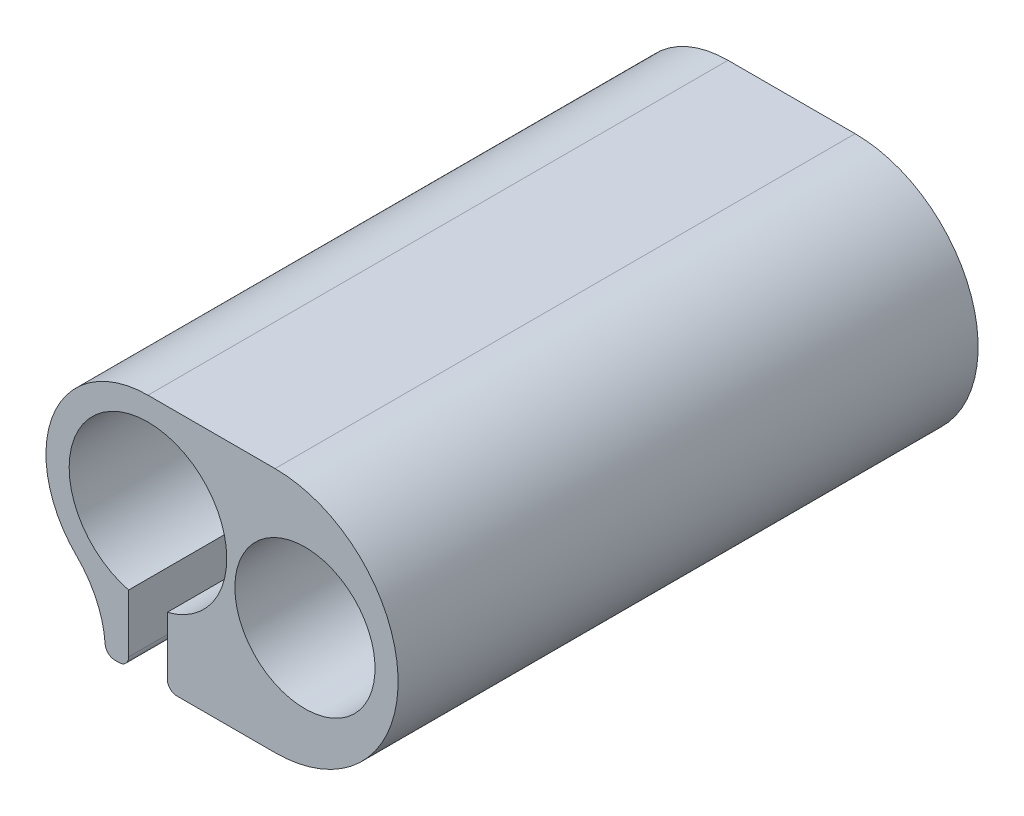
ISO-10303-21;
HEADER;
FILE_DESCRIPTION(('STEP AP214'),'2;1');
FILE_NAME('part.step','',(''),(''),'','','');
FILE_SCHEMA(('AUTOMOTIVE_DESIGN { 1 0 10303 214 1 1 1 1 }'));
ENDSEC;
DATA;
#1=APPLICATION_CONTEXT('core data for automotive mechanical design processes');
#2=APPLICATION_PROTOCOL_DEFINITION('international standard','automotive_design',2000,#1);
#3=PRODUCT_CONTEXT('',#1,'mechanical');
#4=PRODUCT('Part','Part','',(#3));
#5=PRODUCT_RELATED_PRODUCT_CATEGORY('part','',(#4));
#6=PRODUCT_DEFINITION_FORMATION('','',#4);
#7=PRODUCT_DEFINITION_CONTEXT('part definition',#1,'design');
#8=PRODUCT_DEFINITION('design','',#6,#7);
#9=PRODUCT_DEFINITION_SHAPE('','',#8);
#10=(LENGTH_UNIT() NAMED_UNIT(*) SI_UNIT(.MILLI.,.METRE.));
#11=(NAMED_UNIT(*) PLANE_ANGLE_UNIT() SI_UNIT($,.RADIAN.));
#12=(NAMED_UNIT(*) SI_UNIT($,.STERADIAN.) SOLID_ANGLE_UNIT());
#13=UNCERTAINTY_MEASURE_WITH_UNIT(LENGTH_MEASURE(1.E-05),#10,'distance_accuracy_value','');
#14=(GEOMETRIC_REPRESENTATION_CONTEXT(3) GLOBAL_UNCERTAINTY_ASSIGNED_CONTEXT((#13)) GLOBAL_UNIT_ASSIGNED_CONTEXT((#10,
#11,#12)) REPRESENTATION_CONTEXT('',''));
#15=CARTESIAN_POINT('',(0.,0.,0.));
#16=DIRECTION('',(0.,0.,1.));
#17=DIRECTION('',(1.,0.,0.));
#18=AXIS2_PLACEMENT_3D('',#15,#16,#17);
#19=CARTESIAN_POINT('',(0.,0.,60.));
#20=DIRECTION('',(0.,0.,-1.));
#21=DIRECTION('',(-1.,0.,0.));
#22=AXIS2_PLACEMENT_3D('',#19,#20,#21);
#23=CYLINDRICAL_SURFACE('',#22,8.15);
#24=CARTESIAN_POINT('',(0.,0.,0.));
#25=DIRECTION('',(0.,0.,-1.));
#26=DIRECTION('',(-1.,0.,0.));
#27=AXIS2_PLACEMENT_3D('',#24,#25,#26);
#28=CIRCLE('',#27,8.15);
#29=CARTESIAN_POINT('',(-2.,-7.90079109963047,0.));
#30=VERTEX_POINT('',#29);
#31=CARTESIAN_POINT('',(2.,-7.90079109963047,0.));
#32=VERTEX_POINT('',#31);
#33=EDGE_CURVE('E146',#30,#32,#28,.T.);
#34=ORIENTED_EDGE('',*,*,#33,.T.);
#35=DIRECTION('',(0.,0.,-1.));
#36=VECTOR('',#35,1.);
#37=CARTESIAN_POINT('',(2.,-7.90079109963047,60.));
#38=LINE('',#37,#36);
#39=CARTESIAN_POINT('',(2.,-7.90079109963047,60.));
#40=VERTEX_POINT('',#39);
#41=EDGE_CURVE('E130',#40,#32,#38,.T.);
#42=ORIENTED_EDGE('',*,*,#41,.F.);
#43=CARTESIAN_POINT('',(0.,0.,60.));
#44=DIRECTION('',(0.,0.,-1.));
#45=DIRECTION('',(-1.,0.,0.));
#46=AXIS2_PLACEMENT_3D('',#43,#44,#45);
#47=CIRCLE('',#46,8.15);
#48=CARTESIAN_POINT('',(-2.,-7.90079109963047,60.));
#49=VERTEX_POINT('',#48);
#50=EDGE_CURVE('E134',#49,#40,#47,.T.);
#51=ORIENTED_EDGE('',*,*,#50,.F.);
#52=DIRECTION('',(0.,0.,-1.));
#53=VECTOR('',#52,1.);
#54=CARTESIAN_POINT('',(-2.,-7.90079109963047,60.));
#55=LINE('',#54,#53);
#56=EDGE_CURVE('E208',#49,#30,#55,.T.);
#57=ORIENTED_EDGE('',*,*,#56,.T.);
#58=EDGE_LOOP('',(#34,#42,#51,#57));
#59=FACE_BOUND('',#58,.T.);
#60=ADVANCED_FACE('F37',(#59),#23,.F.);
#61=CARTESIAN_POINT('',(2.,-7.90079109963047,60.));
#62=DIRECTION('',(1.,0.,0.));
#63=DIRECTION('',(0.,1.,0.));
#64=AXIS2_PLACEMENT_3D('',#61,#62,#63);
#65=PLANE('',#64);
#66=DIRECTION('',(0.,-1.,0.));
#67=VECTOR('',#66,1.);
#68=CARTESIAN_POINT('',(2.,-7.90079109963047,0.));
#69=LINE('',#68,#67);
#70=CARTESIAN_POINT('',(2.,-13.9007910996305,0.));
#71=VERTEX_POINT('',#70);
#72=EDGE_CURVE('E193',#32,#71,#69,.T.);
#73=ORIENTED_EDGE('',*,*,#72,.T.);
#74=DIRECTION('',(0.,0.,-1.));
#75=VECTOR('',#74,1.);
#76=CARTESIAN_POINT('',(2.,-13.9007910996305,60.));
#77=LINE('',#76,#75);
#78=CARTESIAN_POINT('',(2.,-13.9007910996305,60.));
#79=VERTEX_POINT('',#78);
#80=EDGE_CURVE('E11',#71,#79,#77,.F.);
#81=ORIENTED_EDGE('',*,*,#80,.T.);
#82=DIRECTION('',(0.,-1.,0.));
#83=VECTOR('',#82,1.);
#84=CARTESIAN_POINT('',(2.,-7.90079109963047,60.));
#85=LINE('',#84,#83);
#86=EDGE_CURVE('E125',#40,#79,#85,.T.);
#87=ORIENTED_EDGE('',*,*,#86,.F.);
#88=ORIENTED_EDGE('',*,*,#41,.T.);
#89=EDGE_LOOP('',(#73,#81,#87,#88));
#90=FACE_BOUND('',#89,.T.);
#91=ADVANCED_FACE('F128',(#90),#65,.F.);
#92=CARTESIAN_POINT('',(4.4,-14.9007910996305,60.));
#93=DIRECTION('',(0.,1.,0.));
#94=DIRECTION('',(0.,0.,1.));
#95=AXIS2_PLACEMENT_3D('',#92,#93,#94);
#96=PLANE('',#95);
#97=DIRECTION('',(1.,0.,0.));
#98=VECTOR('',#97,1.);
#99=CARTESIAN_POINT('',(2.,-14.9007910996305,60.));
#100=LINE('',#99,#98);
#101=CARTESIAN_POINT('',(3.,-14.9007910996305,60.));
#102=VERTEX_POINT('',#101);
#103=CARTESIAN_POINT('',(13.1471428727332,-14.9007910996305,60.));
#104=VERTEX_POINT('',#103);
#105=EDGE_CURVE('E133',#102,#104,#100,.T.);
#106=ORIENTED_EDGE('',*,*,#105,.F.);
#107=DIRECTION('',(0.,0.,-1.));
#108=VECTOR('',#107,1.);
#109=CARTESIAN_POINT('',(3.,-14.9007910996305,60.));
#110=LINE('',#109,#108);
#111=CARTESIAN_POINT('',(3.,-14.9007910996305,0.));
#112=VERTEX_POINT('',#111);
#113=EDGE_CURVE('E45',#102,#112,#110,.T.);
#114=ORIENTED_EDGE('',*,*,#113,.T.);
#115=DIRECTION('',(1.,0.,0.));
#116=VECTOR('',#115,1.);
#117=CARTESIAN_POINT('',(4.4,-14.9007910996305,0.));
#118=LINE('',#117,#116);
#119=CARTESIAN_POINT('',(13.1471428727332,-14.9007910996305,0.));
#120=VERTEX_POINT('',#119);
#121=EDGE_CURVE('E185',#112,#120,#118,.T.);
#122=ORIENTED_EDGE('',*,*,#121,.T.);
#123=DIRECTION('',(0.,0.,-1.));
#124=VECTOR('',#123,1.);
#125=CARTESIAN_POINT('',(13.1471428727332,-14.9007910996305,60.));
#126=LINE('',#125,#124);
#127=EDGE_CURVE('E148',#104,#120,#126,.T.);
#128=ORIENTED_EDGE('',*,*,#127,.F.);
#129=EDGE_LOOP('',(#106,#114,#122,#128));
#130=FACE_BOUND('',#129,.T.);
#131=ADVANCED_FACE('F183',(#130),#96,.F.);
#132=CARTESIAN_POINT('',(13.1471428727332,-2.17539554981523,60.));
#133=DIRECTION('',(0.,0.,-1.));
#134=DIRECTION('',(-1.,0.,0.));
#135=AXIS2_PLACEMENT_3D('',#132,#133,#134);
#136=CYLINDRICAL_SURFACE('',#135,12.7253955498152);
#137=CARTESIAN_POINT('',(13.1471428727332,-2.17539554981523,0.));
#138=DIRECTION('',(0.,0.,1.));
#139=DIRECTION('',(-1.,0.,0.));
#140=AXIS2_PLACEMENT_3D('',#137,#138,#139);
#141=CIRCLE('',#140,12.7253955498152);
#142=CARTESIAN_POINT('',(13.1471428727332,10.55,0.));
#143=VERTEX_POINT('',#142);
#144=EDGE_CURVE('E192',#120,#143,#141,.T.);
#145=ORIENTED_EDGE('',*,*,#144,.T.);
#146=DIRECTION('',(0.,0.,-1.));
#147=VECTOR('',#146,1.);
#148=CARTESIAN_POINT('',(13.1471428727332,10.55,60.));
#149=LINE('',#148,#147);
#150=CARTESIAN_POINT('',(13.1471428727332,10.55,60.));
#151=VERTEX_POINT('',#150);
#152=EDGE_CURVE('E153',#151,#143,#149,.T.);
#153=ORIENTED_EDGE('',*,*,#152,.F.);
#154=CARTESIAN_POINT('',(13.1471428727332,-2.17539554981523,60.));
#155=DIRECTION('',(0.,0.,1.));
#156=DIRECTION('',(-1.,0.,0.));
#157=AXIS2_PLACEMENT_3D('',#154,#155,#156);
#158=CIRCLE('',#157,12.7253955498152);
#159=EDGE_CURVE('E261',#104,#151,#158,.T.);
#160=ORIENTED_EDGE('',*,*,#159,.F.);
#161=ORIENTED_EDGE('',*,*,#127,.T.);
#162=EDGE_LOOP('',(#145,#153,#160,#161));
#163=FACE_BOUND('',#162,.T.);
#164=ADVANCED_FACE('F263',(#163),#136,.T.);
#165=CARTESIAN_POINT('',(13.1471428727332,10.55,60.));
#166=DIRECTION('',(0.,-1.,0.));
#167=DIRECTION('',(1.,0.,0.));
#168=AXIS2_PLACEMENT_3D('',#165,#166,#167);
#169=PLANE('',#168);
#170=DIRECTION('',(-1.,0.,0.));
#171=VECTOR('',#170,1.);
#172=CARTESIAN_POINT('',(13.1471428727332,10.55,0.));
#173=LINE('',#172,#171);
#174=CARTESIAN_POINT('',(0.,10.55,0.));
#175=VERTEX_POINT('',#174);
#176=EDGE_CURVE('E195',#143,#175,#173,.T.);
#177=ORIENTED_EDGE('',*,*,#176,.T.);
#178=DIRECTION('',(0.,0.,-1.));
#179=VECTOR('',#178,1.);
#180=CARTESIAN_POINT('',(0.,10.55,60.));
#181=LINE('',#180,#179);
#182=CARTESIAN_POINT('',(0.,10.55,60.));
#183=VERTEX_POINT('',#182);
#184=EDGE_CURVE('E210',#183,#175,#181,.T.);
#185=ORIENTED_EDGE('',*,*,#184,.F.);
#186=DIRECTION('',(-1.,0.,0.));
#187=VECTOR('',#186,1.);
#188=CARTESIAN_POINT('',(13.1471428727332,10.55,60.));
#189=LINE('',#188,#187);
#190=EDGE_CURVE('E218',#151,#183,#189,.T.);
#191=ORIENTED_EDGE('',*,*,#190,.F.);
#192=ORIENTED_EDGE('',*,*,#152,.T.);
#193=EDGE_LOOP('',(#177,#185,#191,#192));
#194=FACE_BOUND('',#193,.T.);
#195=ADVANCED_FACE('F216',(#194),#169,.F.);
#196=CARTESIAN_POINT('',(0.,0.,60.));
#197=DIRECTION('',(0.,0.,-1.));
#198=DIRECTION('',(-1.,0.,0.));
#199=AXIS2_PLACEMENT_3D('',#196,#197,#198);
#200=CYLINDRICAL_SURFACE('',#199,10.55);
#201=CARTESIAN_POINT('',(0.,0.,0.));
#202=DIRECTION('',(0.,0.,1.));
#203=DIRECTION('',(-1.,0.,0.));
#204=AXIS2_PLACEMENT_3D('',#201,#202,#203);
#205=CIRCLE('',#204,10.55);
#206=CARTESIAN_POINT('',(-7.39270072992701,-7.52665104264418,0.));
#207=VERTEX_POINT('',#206);
#208=EDGE_CURVE('E201',#175,#207,#205,.T.);
#209=ORIENTED_EDGE('',*,*,#208,.T.);
#210=DIRECTION('',(0.,0.,-1.));
#211=VECTOR('',#210,1.);
#212=CARTESIAN_POINT('',(-7.39270072992701,-7.52665104264418,60.));
#213=LINE('',#212,#211);
#214=CARTESIAN_POINT('',(-7.39270072992701,-7.52665104264418,60.));
#215=VERTEX_POINT('',#214);
#216=EDGE_CURVE('E147',#207,#215,#213,.F.);
#217=ORIENTED_EDGE('',*,*,#216,.T.);
#218=CARTESIAN_POINT('',(0.,0.,60.));
#219=DIRECTION('',(0.,0.,1.));
#220=DIRECTION('',(-1.,0.,0.));
#221=AXIS2_PLACEMENT_3D('',#218,#219,#220);
#222=CIRCLE('',#221,10.55);
#223=EDGE_CURVE('E234',#183,#215,#222,.T.);
#224=ORIENTED_EDGE('',*,*,#223,.F.);
#225=ORIENTED_EDGE('',*,*,#184,.T.);
#226=EDGE_LOOP('',(#209,#217,#224,#225));
#227=FACE_BOUND('',#226,.T.);
#228=ADVANCED_FACE('F225',(#227),#200,.T.);
#229=CARTESIAN_POINT('',(-4.4,-14.9007910996305,60.));
#230=DIRECTION('',(0.,1.,0.));
#231=DIRECTION('',(0.,0.,1.));
#232=AXIS2_PLACEMENT_3D('',#229,#230,#231);
#233=PLANE('',#232);
#234=DIRECTION('',(1.,0.,0.));
#235=VECTOR('',#234,1.);
#236=CARTESIAN_POINT('',(-4.4,-14.9007910996305,60.));
#237=LINE('',#236,#235);
#238=CARTESIAN_POINT('',(-3.42629470251099,-14.9007910996305,60.));
#239=VERTEX_POINT('',#238);
#240=CARTESIAN_POINT('',(-3.,-14.9007910996305,60.));
#241=VERTEX_POINT('',#240);
#242=EDGE_CURVE('E241',#239,#241,#237,.T.);
#243=ORIENTED_EDGE('',*,*,#242,.F.);
#244=DIRECTION('',(0.,0.,-1.));
#245=VECTOR('',#244,1.);
#246=CARTESIAN_POINT('',(-3.42629470251099,-14.9007910996305,60.));
#247=LINE('',#246,#245);
#248=CARTESIAN_POINT('',(-3.42629470251099,-14.9007910996305,0.));
#249=VERTEX_POINT('',#248);
#250=EDGE_CURVE('E162',#239,#249,#247,.T.);
#251=ORIENTED_EDGE('',*,*,#250,.T.);
#252=DIRECTION('',(1.,0.,0.));
#253=VECTOR('',#252,1.);
#254=CARTESIAN_POINT('',(-4.4,-14.9007910996305,0.));
#255=LINE('',#254,#253);
#256=CARTESIAN_POINT('',(-3.,-14.9007910996305,0.));
#257=VERTEX_POINT('',#256);
#258=EDGE_CURVE('E204',#249,#257,#255,.T.);
#259=ORIENTED_EDGE('',*,*,#258,.T.);
#260=DIRECTION('',(0.,0.,-1.));
#261=VECTOR('',#260,1.);
#262=CARTESIAN_POINT('',(-3.,-14.9007910996305,60.));
#263=LINE('',#262,#261);
#264=EDGE_CURVE('E160',#257,#241,#263,.F.);
#265=ORIENTED_EDGE('',*,*,#264,.T.);
#266=EDGE_LOOP('',(#243,#251,#259,#265));
#267=FACE_BOUND('',#266,.T.);
#268=ADVANCED_FACE('F239',(#267),#233,.F.);
#269=CARTESIAN_POINT('',(-2.,-7.90079109963047,60.));
#270=DIRECTION('',(-1.,0.,0.));
#271=DIRECTION('',(0.,-1.,0.));
#272=AXIS2_PLACEMENT_3D('',#269,#270,#271);
#273=PLANE('',#272);
#274=DIRECTION('',(0.,1.,0.));
#275=VECTOR('',#274,1.);
#276=CARTESIAN_POINT('',(-2.,-7.90079109963047,60.));
#277=LINE('',#276,#275);
#278=CARTESIAN_POINT('',(-2.,-13.9007910996305,60.));
#279=VERTEX_POINT('',#278);
#280=EDGE_CURVE('E139',#279,#49,#277,.T.);
#281=ORIENTED_EDGE('',*,*,#280,.F.);
#282=DIRECTION('',(0.,0.,-1.));
#283=VECTOR('',#282,1.);
#284=CARTESIAN_POINT('',(-2.,-13.9007910996305,60.));
#285=LINE('',#284,#283);
#286=CARTESIAN_POINT('',(-2.,-13.9007910996305,0.));
#287=VERTEX_POINT('',#286);
#288=EDGE_CURVE('E177',#279,#287,#285,.T.);
#289=ORIENTED_EDGE('',*,*,#288,.T.);
#290=DIRECTION('',(0.,1.,0.));
#291=VECTOR('',#290,1.);
#292=CARTESIAN_POINT('',(-2.,-7.90079109963047,0.));
#293=LINE('',#292,#291);
#294=EDGE_CURVE('E143',#287,#30,#293,.T.);
#295=ORIENTED_EDGE('',*,*,#294,.T.);
#296=ORIENTED_EDGE('',*,*,#56,.F.);
#297=EDGE_LOOP('',(#281,#289,#295,#296));
#298=FACE_BOUND('',#297,.T.);
#299=ADVANCED_FACE('F247',(#298),#273,.F.);
#300=CARTESIAN_POINT('',(0.,0.,60.));
#301=DIRECTION('',(0.,0.,-1.));
#302=DIRECTION('',(-1.,0.,0.));
#303=AXIS2_PLACEMENT_3D('',#300,#301,#302);
#304=PLANE('',#303);
#305=CARTESIAN_POINT('',(16.239032389574,-2.17539554981523,60.));
#306=DIRECTION('',(0.,0.,-1.));
#307=DIRECTION('',(-1.,0.,0.));
#308=AXIS2_PLACEMENT_3D('',#305,#306,#307);
#309=CIRCLE('',#308,7.25);
#310=CARTESIAN_POINT('',(8.98903238957403,-2.17539554981523,60.));
#311=VERTEX_POINT('',#310);
#312=EDGE_CURVE('E251',#311,#311,#309,.T.);
#313=ORIENTED_EDGE('',*,*,#312,.T.);
#314=EDGE_LOOP('',(#313));
#315=FACE_BOUND('',#314,.T.);
#316=CARTESIAN_POINT('',(-14.4,-14.6609174337761,60.));
#317=DIRECTION('',(0.,0.,-1.));
#318=DIRECTION('',(-1.,0.,0.));
#319=AXIS2_PLACEMENT_3D('',#316,#317,#318);
#320=CIRCLE('',#319,10.);
#321=CARTESIAN_POINT('',(-4.42390427500999,-13.9698934936437,60.));
#322=VERTEX_POINT('',#321);
#323=EDGE_CURVE('E158',#215,#322,#320,.T.);
#324=ORIENTED_EDGE('',*,*,#323,.T.);
#325=CARTESIAN_POINT('',(-3.42629470251099,-13.9007910996305,60.));
#326=DIRECTION('',(0.,0.,-1.));
#327=DIRECTION('',(-1.,0.,0.));
#328=AXIS2_PLACEMENT_3D('',#325,#326,#327);
#329=CIRCLE('',#328,1.);
#330=EDGE_CURVE('E175',#322,#239,#329,.F.);
#331=ORIENTED_EDGE('',*,*,#330,.T.);
#332=ORIENTED_EDGE('',*,*,#242,.T.);
#333=CARTESIAN_POINT('',(-3.,-13.9007910996305,60.));
#334=DIRECTION('',(0.,0.,-1.));
#335=DIRECTION('',(-1.,0.,0.));
#336=AXIS2_PLACEMENT_3D('',#333,#334,#335);
#337=CIRCLE('',#336,1.);
#338=EDGE_CURVE('E52',#241,#279,#337,.F.);
#339=ORIENTED_EDGE('',*,*,#338,.T.);
#340=ORIENTED_EDGE('',*,*,#280,.T.);
#341=ORIENTED_EDGE('',*,*,#50,.T.);
#342=ORIENTED_EDGE('',*,*,#86,.T.);
#343=CARTESIAN_POINT('',(3.,-13.9007910996305,60.));
#344=DIRECTION('',(0.,0.,-1.));
#345=DIRECTION('',(-1.,0.,0.));
#346=AXIS2_PLACEMENT_3D('',#343,#344,#345);
#347=CIRCLE('',#346,1.);
#348=EDGE_CURVE('E59',#79,#102,#347,.F.);
#349=ORIENTED_EDGE('',*,*,#348,.T.);
#350=ORIENTED_EDGE('',*,*,#105,.T.);
#351=ORIENTED_EDGE('',*,*,#159,.T.);
#352=ORIENTED_EDGE('',*,*,#190,.T.);
#353=ORIENTED_EDGE('',*,*,#223,.T.);
#354=EDGE_LOOP('',(#324,#331,#332,#339,#340,#341,#342,#349,#350,#351,#352,#353));
#355=FACE_BOUND('',#354,.T.);
#356=ADVANCED_FACE('F138',(#315,#355),#304,.F.);
#357=CARTESIAN_POINT('',(0.,0.,0.));
#358=DIRECTION('',(0.,0.,-1.));
#359=DIRECTION('',(-1.,0.,0.));
#360=AXIS2_PLACEMENT_3D('',#357,#358,#359);
#361=PLANE('',#360);
#362=CARTESIAN_POINT('',(16.239032389574,-2.17539554981523,0.));
#363=DIRECTION('',(0.,0.,-1.));
#364=DIRECTION('',(-1.,0.,0.));
#365=AXIS2_PLACEMENT_3D('',#362,#363,#364);
#366=CIRCLE('',#365,7.25);
#367=CARTESIAN_POINT('',(8.98903238957403,-2.17539554981523,0.));
#368=VERTEX_POINT('',#367);
#369=EDGE_CURVE('E253',#368,#368,#366,.T.);
#370=ORIENTED_EDGE('',*,*,#369,.F.);
#371=EDGE_LOOP('',(#370));
#372=FACE_BOUND('',#371,.T.);
#373=ORIENTED_EDGE('',*,*,#258,.F.);
#374=CARTESIAN_POINT('',(-3.42629470251099,-13.9007910996305,0.));
#375=DIRECTION('',(0.,0.,-1.));
#376=DIRECTION('',(-1.,0.,0.));
#377=AXIS2_PLACEMENT_3D('',#374,#375,#376);
#378=CIRCLE('',#377,1.);
#379=CARTESIAN_POINT('',(-4.42390427500999,-13.9698934936437,0.));
#380=VERTEX_POINT('',#379);
#381=EDGE_CURVE('E169',#249,#380,#378,.T.);
#382=ORIENTED_EDGE('',*,*,#381,.T.);
#383=CARTESIAN_POINT('',(-14.4,-14.6609174337761,0.));
#384=DIRECTION('',(0.,0.,-1.));
#385=DIRECTION('',(-1.,0.,0.));
#386=AXIS2_PLACEMENT_3D('',#383,#384,#385);
#387=CIRCLE('',#386,10.);
#388=EDGE_CURVE('E150',#380,#207,#387,.F.);
#389=ORIENTED_EDGE('',*,*,#388,.T.);
#390=ORIENTED_EDGE('',*,*,#208,.F.);
#391=ORIENTED_EDGE('',*,*,#176,.F.);
#392=ORIENTED_EDGE('',*,*,#144,.F.);
#393=ORIENTED_EDGE('',*,*,#121,.F.);
#394=CARTESIAN_POINT('',(3.,-13.9007910996305,0.));
#395=DIRECTION('',(0.,0.,-1.));
#396=DIRECTION('',(-1.,0.,0.));
#397=AXIS2_PLACEMENT_3D('',#394,#395,#396);
#398=CIRCLE('',#397,1.);
#399=EDGE_CURVE('E165',#112,#71,#398,.T.);
#400=ORIENTED_EDGE('',*,*,#399,.T.);
#401=ORIENTED_EDGE('',*,*,#72,.F.);
#402=ORIENTED_EDGE('',*,*,#33,.F.);
#403=ORIENTED_EDGE('',*,*,#294,.F.);
#404=CARTESIAN_POINT('',(-3.,-13.9007910996305,0.));
#405=DIRECTION('',(0.,0.,-1.));
#406=DIRECTION('',(-1.,0.,0.));
#407=AXIS2_PLACEMENT_3D('',#404,#405,#406);
#408=CIRCLE('',#407,1.);
#409=EDGE_CURVE('E167',#287,#257,#408,.T.);
#410=ORIENTED_EDGE('',*,*,#409,.T.);
#411=EDGE_LOOP('',(#373,#382,#389,#390,#391,#392,#393,#400,#401,#402,#403,#410));
#412=FACE_BOUND('',#411,.T.);
#413=ADVANCED_FACE('F190',(#372,#412),#361,.T.);
#414=CARTESIAN_POINT('',(16.239032389574,-2.17539554981523,60.));
#415=DIRECTION('',(0.,0.,-1.));
#416=DIRECTION('',(-1.,0.,0.));
#417=AXIS2_PLACEMENT_3D('',#414,#415,#416);
#418=CYLINDRICAL_SURFACE('',#417,7.25);
#419=ORIENTED_EDGE('',*,*,#312,.F.);
#420=EDGE_LOOP('',(#419));
#421=FACE_BOUND('',#420,.T.);
#422=ORIENTED_EDGE('',*,*,#369,.T.);
#423=EDGE_LOOP('',(#422));
#424=FACE_BOUND('',#423,.T.);
#425=ADVANCED_FACE('F281',(#421,#424),#418,.F.);
#426=CARTESIAN_POINT('',(-14.4,-14.6609174337761,60.));
#427=DIRECTION('',(0.,0.,-1.));
#428=DIRECTION('',(-1.,0.,0.));
#429=AXIS2_PLACEMENT_3D('',#426,#427,#428);
#430=CYLINDRICAL_SURFACE('',#429,10.);
#431=ORIENTED_EDGE('',*,*,#388,.F.);
#432=DIRECTION('',(0.,0.,-1.));
#433=VECTOR('',#432,1.);
#434=CARTESIAN_POINT('',(-4.42390427500999,-13.9698934936437,60.));
#435=LINE('',#434,#433);
#436=EDGE_CURVE('E171',#380,#322,#435,.F.);
#437=ORIENTED_EDGE('',*,*,#436,.T.);
#438=ORIENTED_EDGE('',*,*,#323,.F.);
#439=ORIENTED_EDGE('',*,*,#216,.F.);
#440=EDGE_LOOP('',(#431,#437,#438,#439));
#441=FACE_BOUND('',#440,.T.);
#442=ADVANCED_FACE('F230',(#441),#430,.F.);
#443=CARTESIAN_POINT('',(-3.42629470251099,-13.9007910996305,60.));
#444=DIRECTION('',(0.,0.,-1.));
#445=DIRECTION('',(-1.,0.,0.));
#446=AXIS2_PLACEMENT_3D('',#443,#444,#445);
#447=CYLINDRICAL_SURFACE('',#446,1.);
#448=ORIENTED_EDGE('',*,*,#330,.F.);
#449=ORIENTED_EDGE('',*,*,#436,.F.);
#450=ORIENTED_EDGE('',*,*,#381,.F.);
#451=ORIENTED_EDGE('',*,*,#250,.F.);
#452=EDGE_LOOP('',(#448,#449,#450,#451));
#453=FACE_BOUND('',#452,.T.);
#454=ADVANCED_FACE('F237',(#453),#447,.T.);
#455=CARTESIAN_POINT('',(-3.,-13.9007910996305,60.));
#456=DIRECTION('',(0.,0.,-1.));
#457=DIRECTION('',(-1.,0.,0.));
#458=AXIS2_PLACEMENT_3D('',#455,#456,#457);
#459=CYLINDRICAL_SURFACE('',#458,1.);
#460=ORIENTED_EDGE('',*,*,#338,.F.);
#461=ORIENTED_EDGE('',*,*,#264,.F.);
#462=ORIENTED_EDGE('',*,*,#409,.F.);
#463=ORIENTED_EDGE('',*,*,#288,.F.);
#464=EDGE_LOOP('',(#460,#461,#462,#463));
#465=FACE_BOUND('',#464,.T.);
#466=ADVANCED_FACE('F245',(#465),#459,.T.);
#467=CARTESIAN_POINT('',(3.,-13.9007910996305,60.));
#468=DIRECTION('',(0.,0.,-1.));
#469=DIRECTION('',(-1.,0.,0.));
#470=AXIS2_PLACEMENT_3D('',#467,#468,#469);
#471=CYLINDRICAL_SURFACE('',#470,1.);
#472=ORIENTED_EDGE('',*,*,#348,.F.);
#473=ORIENTED_EDGE('',*,*,#80,.F.);
#474=ORIENTED_EDGE('',*,*,#399,.F.);
#475=ORIENTED_EDGE('',*,*,#113,.F.);
#476=EDGE_LOOP('',(#472,#473,#474,#475));
#477=FACE_BOUND('',#476,.T.);
#478=ADVANCED_FACE('F39',(#477),#471,.T.);
#479=CLOSED_SHELL('',(#60,#91,#131,#164,#195,#228,#268,#299,#356,#413,#425,#442,#454,#466,#478));
#480=MANIFOLD_SOLID_BREP('B2',#479);
#481=ADVANCED_BREP_SHAPE_REPRESENTATION('',(#18,#480),#14);
#482=SHAPE_DEFINITION_REPRESENTATION(#9,#481);
ENDSEC;
END-ISO-10303-21;
